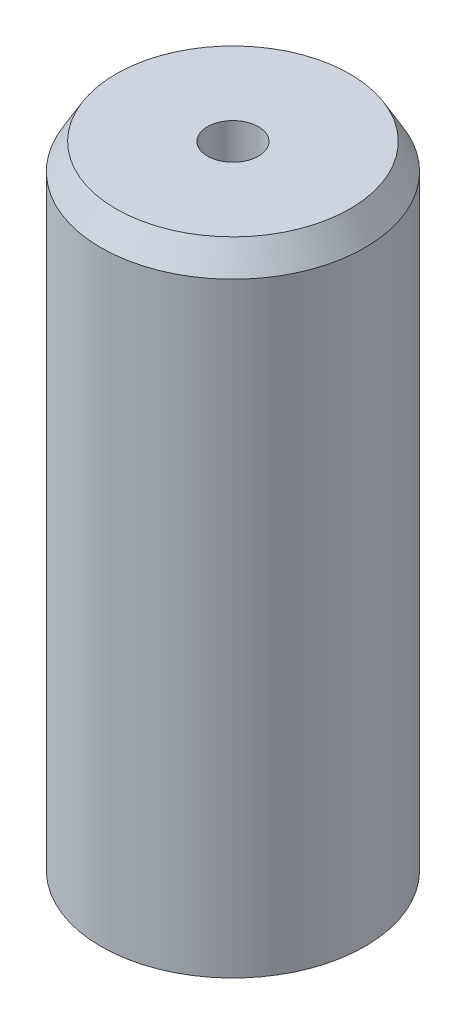
ISO-10303-21;
HEADER;
FILE_DESCRIPTION(('STEP AP214'),'2;1');
FILE_NAME('part.step','',(''),(''),'','','');
FILE_SCHEMA(('AUTOMOTIVE_DESIGN { 1 0 10303 214 1 1 1 1 }'));
ENDSEC;
DATA;
#1=APPLICATION_CONTEXT('core data for automotive mechanical design processes');
#2=APPLICATION_PROTOCOL_DEFINITION('international standard','automotive_design',2000,#1);
#3=PRODUCT_CONTEXT('',#1,'mechanical');
#4=PRODUCT('Part','Part','',(#3));
#5=PRODUCT_RELATED_PRODUCT_CATEGORY('part','',(#4));
#6=PRODUCT_DEFINITION_FORMATION('','',#4);
#7=PRODUCT_DEFINITION_CONTEXT('part definition',#1,'design');
#8=PRODUCT_DEFINITION('design','',#6,#7);
#9=PRODUCT_DEFINITION_SHAPE('','',#8);
#10=(LENGTH_UNIT() NAMED_UNIT(*) SI_UNIT(.MILLI.,.METRE.));
#11=(NAMED_UNIT(*) PLANE_ANGLE_UNIT() SI_UNIT($,.RADIAN.));
#12=(NAMED_UNIT(*) SI_UNIT($,.STERADIAN.) SOLID_ANGLE_UNIT());
#13=UNCERTAINTY_MEASURE_WITH_UNIT(LENGTH_MEASURE(1.E-05),#10,'distance_accuracy_value','');
#14=(GEOMETRIC_REPRESENTATION_CONTEXT(3) GLOBAL_UNCERTAINTY_ASSIGNED_CONTEXT((#13)) GLOBAL_UNIT_ASSIGNED_CONTEXT((#10,
#11,#12)) REPRESENTATION_CONTEXT('',''));
#15=CARTESIAN_POINT('',(0.,0.,0.));
#16=DIRECTION('',(0.,0.,1.));
#17=DIRECTION('',(1.,0.,0.));
#18=AXIS2_PLACEMENT_3D('',#15,#16,#17);
#19=CARTESIAN_POINT('',(0.,24.4843562470189,0.));
#20=DIRECTION('',(0.,-1.,0.));
#21=DIRECTION('',(0.,0.,-1.));
#22=AXIS2_PLACEMENT_3D('',#19,#20,#21);
#23=CYLINDRICAL_SURFACE('',#22,5.);
#24=CARTESIAN_POINT('',(0.,23.4965777151024,0.));
#25=DIRECTION('',(0.,1.,0.));
#26=DIRECTION('',(0.,0.,1.));
#27=AXIS2_PLACEMENT_3D('',#24,#25,#26);
#28=CIRCLE('',#27,5.);
#29=CARTESIAN_POINT('',(0.,23.4965777151024,5.));
#30=VERTEX_POINT('',#29);
#31=EDGE_CURVE('E50',#30,#30,#28,.F.);
#32=ORIENTED_EDGE('',*,*,#31,.T.);
#33=EDGE_LOOP('',(#32));
#34=FACE_BOUND('',#33,.T.);
#35=CARTESIAN_POINT('',(0.,0.570294201301738,0.));
#36=DIRECTION('',(0.,1.,0.));
#37=DIRECTION('',(0.,0.,1.));
#38=AXIS2_PLACEMENT_3D('',#35,#36,#37);
#39=CIRCLE('',#38,5.);
#40=CARTESIAN_POINT('',(0.,0.570294201301738,5.));
#41=VERTEX_POINT('',#40);
#42=EDGE_CURVE('E51',#41,#41,#39,.T.);
#43=ORIENTED_EDGE('',*,*,#42,.T.);
#44=EDGE_LOOP('',(#43));
#45=FACE_BOUND('',#44,.T.);
#46=ADVANCED_FACE('F39',(#34,#45),#23,.T.);
#47=CARTESIAN_POINT('',(0.,24.4843562470189,0.));
#48=DIRECTION('',(0.,1.,0.));
#49=DIRECTION('',(0.,0.,1.));
#50=AXIS2_PLACEMENT_3D('',#47,#48,#49);
#51=PLANE('',#50);
#52=CARTESIAN_POINT('',(0.,24.4843562470189,0.));
#53=DIRECTION('',(0.,1.,0.));
#54=DIRECTION('',(0.,0.,1.));
#55=AXIS2_PLACEMENT_3D('',#52,#53,#54);
#56=CIRCLE('',#55,4.42970579869827);
#57=CARTESIAN_POINT('',(0.,24.4843562470189,4.42970579869827));
#58=VERTEX_POINT('',#57);
#59=EDGE_CURVE('E54',#58,#58,#56,.T.);
#60=ORIENTED_EDGE('',*,*,#59,.T.);
#61=EDGE_LOOP('',(#60));
#62=FACE_BOUND('',#61,.T.);
#63=CARTESIAN_POINT('',(0.,24.4843562470189,0.));
#64=DIRECTION('',(0.,1.,0.));
#65=DIRECTION('',(0.,0.,1.));
#66=AXIS2_PLACEMENT_3D('',#63,#64,#65);
#67=CIRCLE('',#66,0.966676823874661);
#68=CARTESIAN_POINT('',(0.,24.4843562470189,0.966676823874661));
#69=VERTEX_POINT('',#68);
#70=EDGE_CURVE('E58',#69,#69,#67,.T.);
#71=ORIENTED_EDGE('',*,*,#70,.F.);
#72=EDGE_LOOP('',(#71));
#73=FACE_BOUND('',#72,.T.);
#74=ADVANCED_FACE('F69',(#62,#73),#51,.T.);
#75=CARTESIAN_POINT('',(0.,0.,0.));
#76=DIRECTION('',(0.,1.,0.));
#77=DIRECTION('',(0.,0.,1.));
#78=AXIS2_PLACEMENT_3D('',#75,#76,#77);
#79=PLANE('',#78);
#80=CARTESIAN_POINT('',(0.,0.,0.));
#81=DIRECTION('',(0.,1.,0.));
#82=DIRECTION('',(0.,0.,1.));
#83=AXIS2_PLACEMENT_3D('',#80,#81,#82);
#84=CIRCLE('',#83,4.01222146808347);
#85=CARTESIAN_POINT('',(0.,0.,4.01222146808347));
#86=VERTEX_POINT('',#85);
#87=EDGE_CURVE('E10',#86,#86,#84,.F.);
#88=ORIENTED_EDGE('',*,*,#87,.T.);
#89=EDGE_LOOP('',(#88));
#90=FACE_BOUND('',#89,.T.);
#91=CARTESIAN_POINT('',(0.,0.,0.));
#92=DIRECTION('',(0.,1.,0.));
#93=DIRECTION('',(0.,0.,1.));
#94=AXIS2_PLACEMENT_3D('',#91,#92,#93);
#95=CIRCLE('',#94,0.966676823874661);
#96=CARTESIAN_POINT('',(0.,0.,0.966676823874661));
#97=VERTEX_POINT('',#96);
#98=EDGE_CURVE('E63',#97,#97,#95,.T.);
#99=ORIENTED_EDGE('',*,*,#98,.T.);
#100=EDGE_LOOP('',(#99));
#101=FACE_BOUND('',#100,.T.);
#102=ADVANCED_FACE('F75',(#90,#101),#79,.F.);
#103=CARTESIAN_POINT('',(0.,24.4843562470189,0.));
#104=DIRECTION('',(0.,-1.,0.));
#105=DIRECTION('',(0.,0.,-1.));
#106=AXIS2_PLACEMENT_3D('',#103,#104,#105);
#107=CYLINDRICAL_SURFACE('',#106,0.966676823874661);
#108=ORIENTED_EDGE('',*,*,#70,.T.);
#109=EDGE_LOOP('',(#108));
#110=FACE_BOUND('',#109,.T.);
#111=ORIENTED_EDGE('',*,*,#98,.F.);
#112=EDGE_LOOP('',(#111));
#113=FACE_BOUND('',#112,.T.);
#114=ADVANCED_FACE('F70',(#110,#113),#107,.F.);
#115=CARTESIAN_POINT('',(0.,24.4843562470189,0.));
#116=DIRECTION('',(0.,-1.,0.));
#117=DIRECTION('',(0.,0.,-1.));
#118=AXIS2_PLACEMENT_3D('',#115,#116,#117);
#119=CONICAL_SURFACE('',#118,4.42970579869827,0.523598775598295);
#120=ORIENTED_EDGE('',*,*,#31,.F.);
#121=EDGE_LOOP('',(#120));
#122=FACE_BOUND('',#121,.T.);
#123=ORIENTED_EDGE('',*,*,#59,.F.);
#124=EDGE_LOOP('',(#123));
#125=FACE_BOUND('',#124,.T.);
#126=ADVANCED_FACE('F81',(#122,#125),#119,.T.);
#127=CARTESIAN_POINT('',(0.,0.570294201301738,0.));
#128=DIRECTION('',(0.,1.,0.));
#129=DIRECTION('',(0.,0.,1.));
#130=AXIS2_PLACEMENT_3D('',#127,#128,#129);
#131=CONICAL_SURFACE('',#130,5.,1.0471975511966);
#132=ORIENTED_EDGE('',*,*,#87,.F.);
#133=EDGE_LOOP('',(#132));
#134=FACE_BOUND('',#133,.T.);
#135=ORIENTED_EDGE('',*,*,#42,.F.);
#136=EDGE_LOOP('',(#135));
#137=FACE_BOUND('',#136,.T.);
#138=ADVANCED_FACE('F45',(#134,#137),#131,.T.);
#139=CLOSED_SHELL('',(#46,#74,#102,#114,#126,#138));
#140=MANIFOLD_SOLID_BREP('B2',#139);
#141=ADVANCED_BREP_SHAPE_REPRESENTATION('',(#18,#140),#14);
#142=SHAPE_DEFINITION_REPRESENTATION(#9,#141);
ENDSEC;
END-ISO-10303-21;
